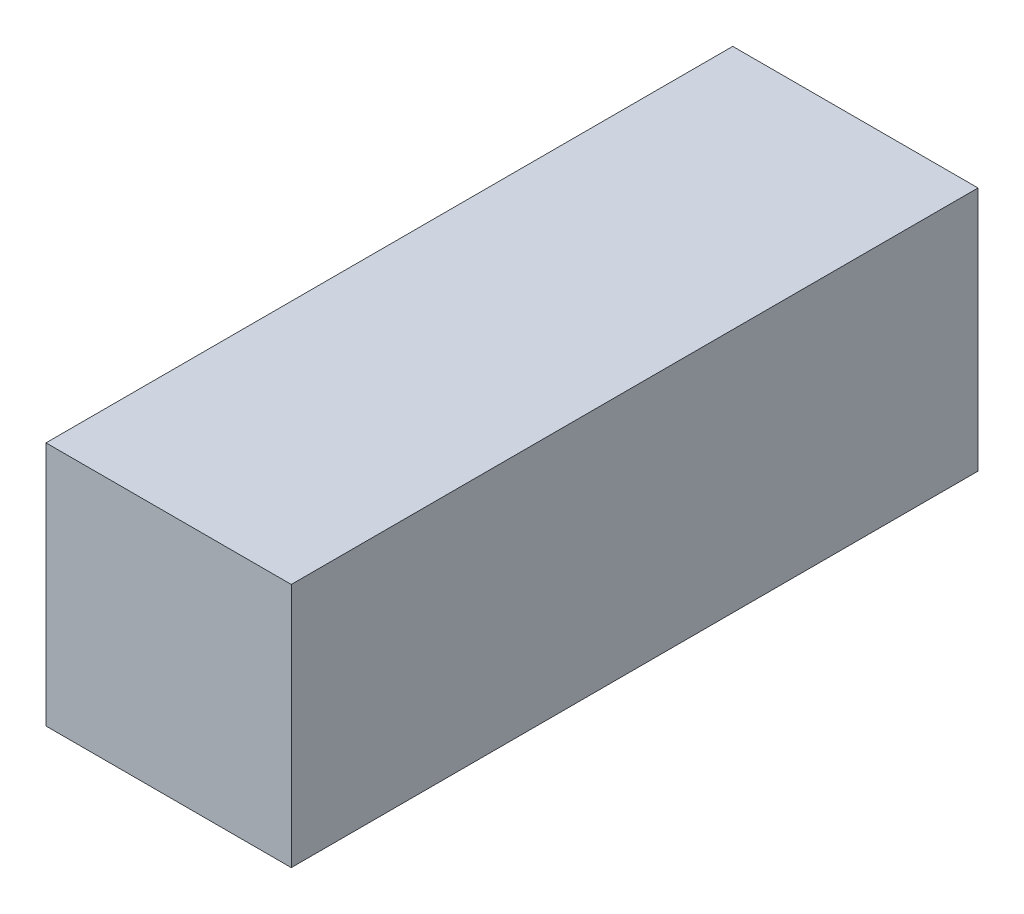
ISO-10303-21;
HEADER;
FILE_DESCRIPTION(('STEP AP214'),'2;1');
FILE_NAME('part.step','',(''),(''),'','','');
FILE_SCHEMA(('AUTOMOTIVE_DESIGN { 1 0 10303 214 1 1 1 1 }'));
ENDSEC;
DATA;
#1=APPLICATION_CONTEXT('core data for automotive mechanical design processes');
#2=APPLICATION_PROTOCOL_DEFINITION('international standard','automotive_design',2000,#1);
#3=PRODUCT_CONTEXT('',#1,'mechanical');
#4=PRODUCT('Part','Part','',(#3));
#5=PRODUCT_RELATED_PRODUCT_CATEGORY('part','',(#4));
#6=PRODUCT_DEFINITION_FORMATION('','',#4);
#7=PRODUCT_DEFINITION_CONTEXT('part definition',#1,'design');
#8=PRODUCT_DEFINITION('design','',#6,#7);
#9=PRODUCT_DEFINITION_SHAPE('','',#8);
#10=(LENGTH_UNIT() NAMED_UNIT(*) SI_UNIT(.MILLI.,.METRE.));
#11=(NAMED_UNIT(*) PLANE_ANGLE_UNIT() SI_UNIT($,.RADIAN.));
#12=(NAMED_UNIT(*) SI_UNIT($,.STERADIAN.) SOLID_ANGLE_UNIT());
#13=UNCERTAINTY_MEASURE_WITH_UNIT(LENGTH_MEASURE(1.E-05),#10,'distance_accuracy_value','');
#14=(GEOMETRIC_REPRESENTATION_CONTEXT(3) GLOBAL_UNCERTAINTY_ASSIGNED_CONTEXT((#13)) GLOBAL_UNIT_ASSIGNED_CONTEXT((#10,
#11,#12)) REPRESENTATION_CONTEXT('',''));
#15=CARTESIAN_POINT('',(0.,0.,0.));
#16=DIRECTION('',(0.,0.,1.));
#17=DIRECTION('',(1.,0.,0.));
#18=AXIS2_PLACEMENT_3D('',#15,#16,#17);
#19=CARTESIAN_POINT('',(0.,0.,140.));
#20=DIRECTION('',(-1.,0.,0.));
#21=DIRECTION('',(0.,0.,1.));
#22=AXIS2_PLACEMENT_3D('',#19,#20,#21);
#23=PLANE('',#22);
#24=DIRECTION('',(0.,1.,0.));
#25=VECTOR('',#24,1.);
#26=CARTESIAN_POINT('',(0.,0.,0.));
#27=LINE('',#26,#25);
#28=CARTESIAN_POINT('',(0.,0.,0.));
#29=VERTEX_POINT('',#28);
#30=CARTESIAN_POINT('',(0.,50.,0.));
#31=VERTEX_POINT('',#30);
#32=EDGE_CURVE('E111',#29,#31,#27,.T.);
#33=ORIENTED_EDGE('',*,*,#32,.T.);
#34=DIRECTION('',(0.,0.,-1.));
#35=VECTOR('',#34,1.);
#36=CARTESIAN_POINT('',(0.,50.,140.));
#37=LINE('',#36,#35);
#38=CARTESIAN_POINT('',(0.,50.,140.));
#39=VERTEX_POINT('',#38);
#40=EDGE_CURVE('E11',#39,#31,#37,.T.);
#41=ORIENTED_EDGE('',*,*,#40,.F.);
#42=DIRECTION('',(0.,1.,0.));
#43=VECTOR('',#42,1.);
#44=CARTESIAN_POINT('',(0.,0.,140.));
#45=LINE('',#44,#43);
#46=CARTESIAN_POINT('',(0.,0.,140.));
#47=VERTEX_POINT('',#46);
#48=EDGE_CURVE('E95',#47,#39,#45,.T.);
#49=ORIENTED_EDGE('',*,*,#48,.F.);
#50=DIRECTION('',(0.,0.,-1.));
#51=VECTOR('',#50,1.);
#52=CARTESIAN_POINT('',(0.,0.,140.));
#53=LINE('',#52,#51);
#54=EDGE_CURVE('E107',#47,#29,#53,.T.);
#55=ORIENTED_EDGE('',*,*,#54,.T.);
#56=EDGE_LOOP('',(#33,#41,#49,#55));
#57=FACE_BOUND('',#56,.T.);
#58=ADVANCED_FACE('F43',(#57),#23,.F.);
#59=CARTESIAN_POINT('',(0.,50.,140.));
#60=DIRECTION('',(0.,-1.,0.));
#61=DIRECTION('',(1.,0.,0.));
#62=AXIS2_PLACEMENT_3D('',#59,#60,#61);
#63=PLANE('',#62);
#64=DIRECTION('',(-1.,0.,0.));
#65=VECTOR('',#64,1.);
#66=CARTESIAN_POINT('',(0.,50.,0.));
#67=LINE('',#66,#65);
#68=CARTESIAN_POINT('',(-50.,50.,0.));
#69=VERTEX_POINT('',#68);
#70=EDGE_CURVE('E100',#31,#69,#67,.T.);
#71=ORIENTED_EDGE('',*,*,#70,.T.);
#72=DIRECTION('',(0.,0.,-1.));
#73=VECTOR('',#72,1.);
#74=CARTESIAN_POINT('',(-50.,50.,140.));
#75=LINE('',#74,#73);
#76=CARTESIAN_POINT('',(-50.,50.,140.));
#77=VERTEX_POINT('',#76);
#78=EDGE_CURVE('E52',#77,#69,#75,.T.);
#79=ORIENTED_EDGE('',*,*,#78,.F.);
#80=DIRECTION('',(-1.,0.,0.));
#81=VECTOR('',#80,1.);
#82=CARTESIAN_POINT('',(0.,50.,140.));
#83=LINE('',#82,#81);
#84=EDGE_CURVE('E90',#39,#77,#83,.T.);
#85=ORIENTED_EDGE('',*,*,#84,.F.);
#86=ORIENTED_EDGE('',*,*,#40,.T.);
#87=EDGE_LOOP('',(#71,#79,#85,#86));
#88=FACE_BOUND('',#87,.T.);
#89=ADVANCED_FACE('F99',(#88),#63,.F.);
#90=CARTESIAN_POINT('',(-50.,0.,140.));
#91=DIRECTION('',(1.,0.,0.));
#92=DIRECTION('',(0.,0.,-1.));
#93=AXIS2_PLACEMENT_3D('',#90,#91,#92);
#94=PLANE('',#93);
#95=DIRECTION('',(0.,-1.,0.));
#96=VECTOR('',#95,1.);
#97=CARTESIAN_POINT('',(-50.,0.,0.));
#98=LINE('',#97,#96);
#99=CARTESIAN_POINT('',(-50.,0.,0.));
#100=VERTEX_POINT('',#99);
#101=EDGE_CURVE('E77',#69,#100,#98,.T.);
#102=ORIENTED_EDGE('',*,*,#101,.T.);
#103=DIRECTION('',(0.,0.,-1.));
#104=VECTOR('',#103,1.);
#105=CARTESIAN_POINT('',(-50.,0.,140.));
#106=LINE('',#105,#104);
#107=CARTESIAN_POINT('',(-50.,0.,140.));
#108=VERTEX_POINT('',#107);
#109=EDGE_CURVE('E102',#108,#100,#106,.T.);
#110=ORIENTED_EDGE('',*,*,#109,.F.);
#111=DIRECTION('',(0.,-1.,0.));
#112=VECTOR('',#111,1.);
#113=CARTESIAN_POINT('',(-50.,0.,140.));
#114=LINE('',#113,#112);
#115=EDGE_CURVE('E93',#77,#108,#114,.T.);
#116=ORIENTED_EDGE('',*,*,#115,.F.);
#117=ORIENTED_EDGE('',*,*,#78,.T.);
#118=EDGE_LOOP('',(#102,#110,#116,#117));
#119=FACE_BOUND('',#118,.T.);
#120=ADVANCED_FACE('F103',(#119),#94,.F.);
#121=CARTESIAN_POINT('',(0.,0.,140.));
#122=DIRECTION('',(0.,1.,0.));
#123=DIRECTION('',(-1.,0.,0.));
#124=AXIS2_PLACEMENT_3D('',#121,#122,#123);
#125=PLANE('',#124);
#126=DIRECTION('',(1.,0.,0.));
#127=VECTOR('',#126,1.);
#128=CARTESIAN_POINT('',(0.,0.,0.));
#129=LINE('',#128,#127);
#130=EDGE_CURVE('E83',#100,#29,#129,.T.);
#131=ORIENTED_EDGE('',*,*,#130,.T.);
#132=ORIENTED_EDGE('',*,*,#54,.F.);
#133=DIRECTION('',(1.,0.,0.));
#134=VECTOR('',#133,1.);
#135=CARTESIAN_POINT('',(0.,0.,140.));
#136=LINE('',#135,#134);
#137=EDGE_CURVE('E60',#108,#47,#136,.T.);
#138=ORIENTED_EDGE('',*,*,#137,.F.);
#139=ORIENTED_EDGE('',*,*,#109,.T.);
#140=EDGE_LOOP('',(#131,#132,#138,#139));
#141=FACE_BOUND('',#140,.T.);
#142=ADVANCED_FACE('F124',(#141),#125,.F.);
#143=CARTESIAN_POINT('',(0.,0.,140.));
#144=DIRECTION('',(0.,0.,1.));
#145=DIRECTION('',(1.,0.,0.));
#146=AXIS2_PLACEMENT_3D('',#143,#144,#145);
#147=PLANE('',#146);
#148=ORIENTED_EDGE('',*,*,#48,.T.);
#149=ORIENTED_EDGE('',*,*,#84,.T.);
#150=ORIENTED_EDGE('',*,*,#115,.T.);
#151=ORIENTED_EDGE('',*,*,#137,.T.);
#152=EDGE_LOOP('',(#148,#149,#150,#151));
#153=FACE_BOUND('',#152,.T.);
#154=ADVANCED_FACE('F91',(#153),#147,.T.);
#155=CARTESIAN_POINT('',(0.,0.,0.));
#156=DIRECTION('',(0.,0.,1.));
#157=DIRECTION('',(1.,0.,0.));
#158=AXIS2_PLACEMENT_3D('',#155,#156,#157);
#159=PLANE('',#158);
#160=ORIENTED_EDGE('',*,*,#32,.F.);
#161=ORIENTED_EDGE('',*,*,#130,.F.);
#162=ORIENTED_EDGE('',*,*,#101,.F.);
#163=ORIENTED_EDGE('',*,*,#70,.F.);
#164=EDGE_LOOP('',(#160,#161,#162,#163));
#165=FACE_BOUND('',#164,.T.);
#166=ADVANCED_FACE('F127',(#165),#159,.F.);
#167=CLOSED_SHELL('',(#58,#89,#120,#142,#154,#166));
#168=MANIFOLD_SOLID_BREP('B2',#167);
#169=ADVANCED_BREP_SHAPE_REPRESENTATION('',(#18,#168),#14);
#170=SHAPE_DEFINITION_REPRESENTATION(#9,#169);
ENDSEC;
END-ISO-10303-21;
